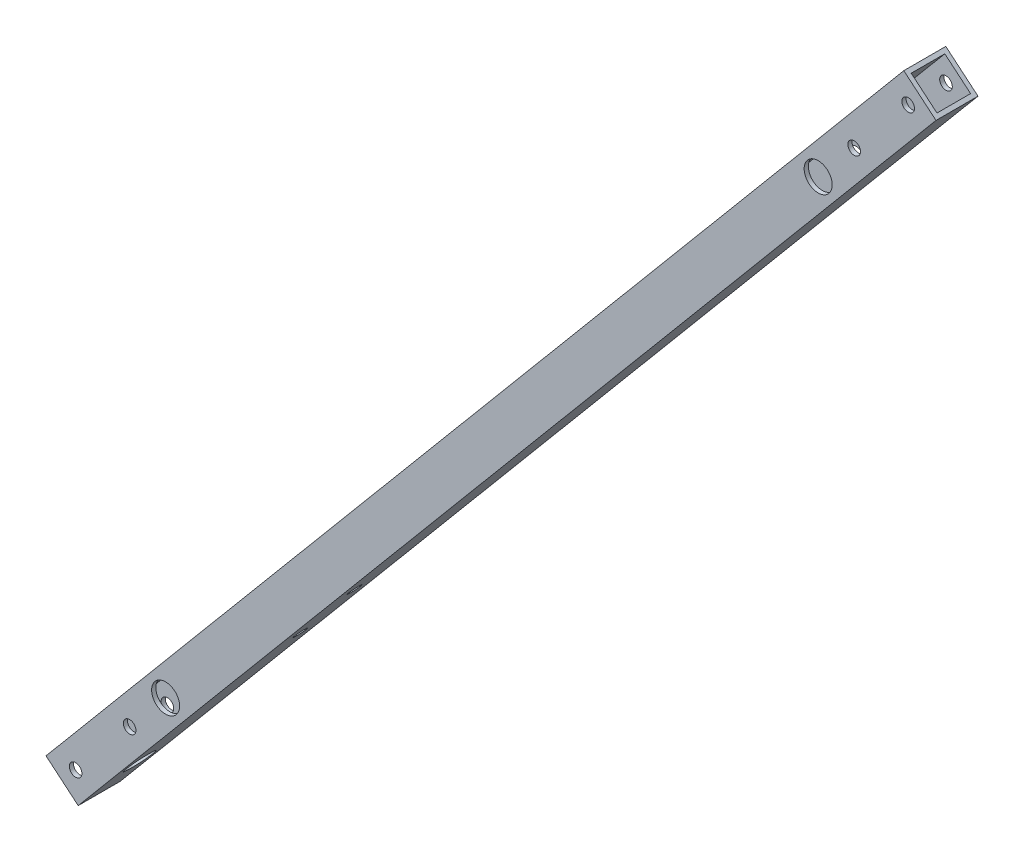
ISO-10303-21;
HEADER;
FILE_DESCRIPTION(('STEP AP214'),'2;1');
FILE_NAME('part.step','',(''),(''),'','','');
FILE_SCHEMA(('AUTOMOTIVE_DESIGN { 1 0 10303 214 1 1 1 1 }'));
ENDSEC;
DATA;
#1=APPLICATION_CONTEXT('core data for automotive mechanical design processes');
#2=APPLICATION_PROTOCOL_DEFINITION('international standard','automotive_design',2000,#1);
#3=PRODUCT_CONTEXT('',#1,'mechanical');
#4=PRODUCT('Part','Part','',(#3));
#5=PRODUCT_RELATED_PRODUCT_CATEGORY('part','',(#4));
#6=PRODUCT_DEFINITION_FORMATION('','',#4);
#7=PRODUCT_DEFINITION_CONTEXT('part definition',#1,'design');
#8=PRODUCT_DEFINITION('design','',#6,#7);
#9=PRODUCT_DEFINITION_SHAPE('','',#8);
#10=(LENGTH_UNIT() NAMED_UNIT(*) SI_UNIT(.MILLI.,.METRE.));
#11=(NAMED_UNIT(*) PLANE_ANGLE_UNIT() SI_UNIT($,.RADIAN.));
#12=(NAMED_UNIT(*) SI_UNIT($,.STERADIAN.) SOLID_ANGLE_UNIT());
#13=UNCERTAINTY_MEASURE_WITH_UNIT(LENGTH_MEASURE(1.E-05),#10,'distance_accuracy_value','');
#14=(GEOMETRIC_REPRESENTATION_CONTEXT(3) GLOBAL_UNCERTAINTY_ASSIGNED_CONTEXT((#13)) GLOBAL_UNIT_ASSIGNED_CONTEXT((#10,
#11,#12)) REPRESENTATION_CONTEXT('',''));
#15=CARTESIAN_POINT('',(0.,0.,0.));
#16=DIRECTION('',(0.,0.,1.));
#17=DIRECTION('',(1.,0.,0.));
#18=AXIS2_PLACEMENT_3D('',#15,#16,#17);
#19=CARTESIAN_POINT('',(0.,0.,13.5));
#20=DIRECTION('',(0.,0.,-1.));
#21=DIRECTION('',(-1.,0.,0.));
#22=AXIS2_PLACEMENT_3D('',#19,#20,#21);
#23=PLANE('',#22);
#24=CARTESIAN_POINT('',(31.2149542335838,48.8684625519902,13.5));
#25=DIRECTION('',(0.,0.,1.));
#26=DIRECTION('',(1.,0.,0.));
#27=AXIS2_PLACEMENT_3D('',#24,#25,#26);
#28=CIRCLE('',#27,4.99999999999999);
#29=CARTESIAN_POINT('',(36.2149542335838,48.8684625519902,13.5));
#30=VERTEX_POINT('',#29);
#31=EDGE_CURVE('E401',#30,#30,#28,.T.);
#32=ORIENTED_EDGE('',*,*,#31,.T.);
#33=EDGE_LOOP('',(#32));
#34=FACE_BOUND('',#33,.T.);
#35=CARTESIAN_POINT('',(277.034916912995,341.825286206554,13.5));
#36=DIRECTION('',(0.,0.,-1.));
#37=DIRECTION('',(-1.,0.,0.));
#38=AXIS2_PLACEMENT_3D('',#35,#36,#37);
#39=CIRCLE('',#38,2.24999999999996);
#40=CARTESIAN_POINT('',(274.784916912995,341.825286206554,13.5));
#41=VERTEX_POINT('',#40);
#42=EDGE_CURVE('E196',#41,#41,#39,.T.);
#43=ORIENTED_EDGE('',*,*,#42,.F.);
#44=EDGE_LOOP('',(#43));
#45=FACE_BOUND('',#44,.T.);
#46=CARTESIAN_POINT('',(18.3592020398528,33.5475736896108,13.5));
#47=DIRECTION('',(0.,0.,-1.));
#48=DIRECTION('',(-1.,0.,0.));
#49=AXIS2_PLACEMENT_3D('',#46,#47,#48);
#50=CIRCLE('',#49,2.25);
#51=CARTESIAN_POINT('',(16.1092020398528,33.5475736896108,13.5));
#52=VERTEX_POINT('',#51);
#53=EDGE_CURVE('E201',#52,#52,#50,.T.);
#54=ORIENTED_EDGE('',*,*,#53,.F.);
#55=EDGE_LOOP('',(#54));
#56=FACE_BOUND('',#55,.T.);
#57=CARTESIAN_POINT('',(-0.924426250743316,10.5662403960414,13.5));
#58=DIRECTION('',(0.,0.,-1.));
#59=DIRECTION('',(-1.,0.,0.));
#60=AXIS2_PLACEMENT_3D('',#57,#58,#59);
#61=CIRCLE('',#60,2.25);
#62=CARTESIAN_POINT('',(-3.17442625074332,10.5662403960414,13.5));
#63=VERTEX_POINT('',#62);
#64=EDGE_CURVE('E207',#63,#63,#61,.T.);
#65=ORIENTED_EDGE('',*,*,#64,.F.);
#66=EDGE_LOOP('',(#65));
#67=FACE_BOUND('',#66,.T.);
#68=CARTESIAN_POINT('',(296.318545203591,364.806619500123,13.5));
#69=DIRECTION('',(0.,0.,-1.));
#70=DIRECTION('',(-1.,0.,0.));
#71=AXIS2_PLACEMENT_3D('',#68,#69,#70);
#72=CIRCLE('',#71,2.24999999999996);
#73=CARTESIAN_POINT('',(294.068545203591,364.806619500123,13.5));
#74=VERTEX_POINT('',#73);
#75=EDGE_CURVE('E219',#74,#74,#72,.T.);
#76=ORIENTED_EDGE('',*,*,#75,.F.);
#77=EDGE_LOOP('',(#76));
#78=FACE_BOUND('',#77,.T.);
#79=DIRECTION('',(0.766044443118979,-0.642787609686539,0.));
#80=VECTOR('',#79,1.);
#81=CARTESIAN_POINT('',(295.900398007839,373.642634038516,13.5));
#82=LINE('',#81,#80);
#83=CARTESIAN_POINT('',(295.900398007839,373.642634038516,13.5));
#84=VERTEX_POINT('',#83);
#85=CARTESIAN_POINT('',(305.092931325267,365.929182722278,13.5));
#86=VERTEX_POINT('',#85);
#87=EDGE_CURVE('E429',#84,#86,#82,.T.);
#88=ORIENTED_EDGE('',*,*,#87,.T.);
#89=DIRECTION('',(0.642787609686538,0.766044443118979,0.));
#90=VECTOR('',#89,1.);
#91=CARTESIAN_POINT('',(-1.14906666467847,0.964181414529808,13.5));
#92=LINE('',#91,#90);
#93=CARTESIAN_POINT('',(-1.14906666467847,0.964181414529808,13.5));
#94=VERTEX_POINT('',#93);
#95=EDGE_CURVE('E125',#94,#86,#92,.T.);
#96=ORIENTED_EDGE('',*,*,#95,.F.);
#97=DIRECTION('',(0.76604444311898,-0.642787609686537,0.));
#98=VECTOR('',#97,1.);
#99=CARTESIAN_POINT('',(0.,0.,13.5));
#100=LINE('',#99,#98);
#101=CARTESIAN_POINT('',(-10.3415999821062,8.67763273076828,13.5));
#102=VERTEX_POINT('',#101);
#103=EDGE_CURVE('E139',#102,#94,#100,.T.);
#104=ORIENTED_EDGE('',*,*,#103,.F.);
#105=DIRECTION('',(-0.642787609686538,-0.766044443118979,0.));
#106=VECTOR('',#105,1.);
#107=CARTESIAN_POINT('',(-10.3415999821063,8.67763273076831,13.5));
#108=LINE('',#107,#106);
#109=EDGE_CURVE('E148',#84,#102,#108,.T.);
#110=ORIENTED_EDGE('',*,*,#109,.F.);
#111=EDGE_LOOP('',(#88,#96,#104,#110));
#112=FACE_BOUND('',#111,.T.);
#113=CARTESIAN_POINT('',(264.179164719264,326.504397344175,13.5));
#114=DIRECTION('',(0.,0.,1.));
#115=DIRECTION('',(1.,0.,0.));
#116=AXIS2_PLACEMENT_3D('',#113,#114,#115);
#117=CIRCLE('',#116,5.);
#118=CARTESIAN_POINT('',(269.179164719264,326.504397344175,13.5));
#119=VERTEX_POINT('',#118);
#120=EDGE_CURVE('E416',#119,#119,#117,.T.);
#121=ORIENTED_EDGE('',*,*,#120,.T.);
#122=EDGE_LOOP('',(#121));
#123=FACE_BOUND('',#122,.T.);
#124=ADVANCED_FACE('F43',(#34,#45,#56,#67,#78,#112,#123),#23,.T.);
#125=CARTESIAN_POINT('',(305.735718934954,366.695227165397,15.));
#126=DIRECTION('',(-0.766044443118979,0.642787609686538,0.));
#127=DIRECTION('',(-0.642787609686538,-0.766044443118979,0.));
#128=AXIS2_PLACEMENT_3D('',#125,#126,#127);
#129=PLANE('',#128);
#130=CARTESIAN_POINT('',(70.7289904301706,86.6251141860083,7.5));
#131=DIRECTION('',(-0.766044443118979,0.642787609686538,0.));
#132=DIRECTION('',(-0.642787609686538,-0.766044443118979,0.));
#133=AXIS2_PLACEMENT_3D('',#130,#131,#132);
#134=CIRCLE('',#133,2.25);
#135=CARTESIAN_POINT('',(69.2827183083759,84.9015141889906,7.5));
#136=VERTEX_POINT('',#135);
#137=EDGE_CURVE('E227',#136,#136,#134,.T.);
#138=ORIENTED_EDGE('',*,*,#137,.F.);
#139=EDGE_LOOP('',(#138));
#140=FACE_BOUND('',#139,.T.);
#141=CARTESIAN_POINT('',(90.0126187207668,109.606447479578,7.5));
#142=DIRECTION('',(-0.766044443118979,0.642787609686538,0.));
#143=DIRECTION('',(-0.642787609686538,-0.766044443118979,0.));
#144=AXIS2_PLACEMENT_3D('',#141,#142,#143);
#145=CIRCLE('',#144,2.25);
#146=CARTESIAN_POINT('',(88.566346598972,107.88284748256,7.5));
#147=VERTEX_POINT('',#146);
#148=EDGE_CURVE('E245',#147,#147,#145,.T.);
#149=ORIENTED_EDGE('',*,*,#148,.F.);
#150=EDGE_LOOP('',(#149));
#151=FACE_BOUND('',#150,.T.);
#152=DIRECTION('',(0.,0.,-1.));
#153=VECTOR('',#152,1.);
#154=CARTESIAN_POINT('',(305.092931325267,365.929182722278,13.5));
#155=LINE('',#154,#153);
#156=CARTESIAN_POINT('',(305.092931325267,365.929182722278,1.5));
#157=VERTEX_POINT('',#156);
#158=EDGE_CURVE('E111',#86,#157,#155,.T.);
#159=ORIENTED_EDGE('',*,*,#158,.T.);
#160=DIRECTION('',(0.642787609686538,0.766044443118979,0.));
#161=VECTOR('',#160,1.);
#162=CARTESIAN_POINT('',(-1.14906666467847,0.964181414529808,1.5));
#163=LINE('',#162,#161);
#164=CARTESIAN_POINT('',(-1.14906666467847,0.964181414529808,1.5));
#165=VERTEX_POINT('',#164);
#166=EDGE_CURVE('E123',#165,#157,#163,.T.);
#167=ORIENTED_EDGE('',*,*,#166,.F.);
#168=DIRECTION('',(0.,0.,-1.));
#169=VECTOR('',#168,1.);
#170=CARTESIAN_POINT('',(-1.14906666467846,0.964181414529863,15.));
#171=LINE('',#170,#169);
#172=EDGE_CURVE('E152',#94,#165,#171,.T.);
#173=ORIENTED_EDGE('',*,*,#172,.F.);
#174=ORIENTED_EDGE('',*,*,#95,.T.);
#175=EDGE_LOOP('',(#159,#167,#173,#174));
#176=FACE_BOUND('',#175,.T.);
#177=CARTESIAN_POINT('',(13.3136545532686,18.2001813847068,7.5));
#178=DIRECTION('',(0.766044443118979,-0.642787609686538,0.));
#179=DIRECTION('',(0.642787609686538,0.766044443118979,0.));
#180=AXIS2_PLACEMENT_3D('',#177,#178,#179);
#181=CIRCLE('',#180,4.99999999999999);
#182=CARTESIAN_POINT('',(16.5275926017013,22.0304036003017,7.5));
#183=VERTEX_POINT('',#182);
#184=EDGE_CURVE('E127',#183,#183,#181,.T.);
#185=ORIENTED_EDGE('',*,*,#184,.T.);
#186=EDGE_LOOP('',(#185));
#187=FACE_BOUND('',#186,.T.);
#188=ADVANCED_FACE('F120',(#140,#151,#176,#187),#129,.T.);
#189=CARTESIAN_POINT('',(-11.4906666467847,9.64181414529806,15.));
#190=DIRECTION('',(0.642787609686537,0.76604444311898,0.));
#191=DIRECTION('',(-0.76604444311898,0.642787609686537,0.));
#192=AXIS2_PLACEMENT_3D('',#189,#190,#191);
#193=PLANE('',#192);
#194=DIRECTION('',(0.76604444311898,-0.642787609686537,0.));
#195=VECTOR('',#194,1.);
#196=CARTESIAN_POINT('',(-11.4906666467847,9.64181414529806,0.));
#197=LINE('',#196,#195);
#198=CARTESIAN_POINT('',(-11.4906666467847,9.64181414529806,0.));
#199=VERTEX_POINT('',#198);
#200=CARTESIAN_POINT('',(0.,0.,0.));
#201=VERTEX_POINT('',#200);
#202=EDGE_CURVE('E155',#199,#201,#197,.T.);
#203=ORIENTED_EDGE('',*,*,#202,.T.);
#204=DIRECTION('',(0.,0.,-1.));
#205=VECTOR('',#204,1.);
#206=CARTESIAN_POINT('',(0.,0.,15.));
#207=LINE('',#206,#205);
#208=CARTESIAN_POINT('',(0.,0.,15.));
#209=VERTEX_POINT('',#208);
#210=EDGE_CURVE('E11',#209,#201,#207,.T.);
#211=ORIENTED_EDGE('',*,*,#210,.F.);
#212=DIRECTION('',(0.76604444311898,-0.642787609686537,0.));
#213=VECTOR('',#212,1.);
#214=CARTESIAN_POINT('',(-11.4906666467847,9.64181414529806,15.));
#215=LINE('',#214,#213);
#216=CARTESIAN_POINT('',(-11.4906666467847,9.64181414529806,15.));
#217=VERTEX_POINT('',#216);
#218=EDGE_CURVE('E162',#217,#209,#215,.T.);
#219=ORIENTED_EDGE('',*,*,#218,.F.);
#220=DIRECTION('',(0.,0.,-1.));
#221=VECTOR('',#220,1.);
#222=CARTESIAN_POINT('',(-11.4906666467847,9.64181414529806,15.));
#223=LINE('',#222,#221);
#224=EDGE_CURVE('E53',#217,#199,#223,.T.);
#225=ORIENTED_EDGE('',*,*,#224,.T.);
#226=EDGE_LOOP('',(#203,#211,#219,#225));
#227=FACE_BOUND('',#226,.T.);
#228=DIRECTION('',(0.76604444311898,-0.642787609686537,0.));
#229=VECTOR('',#228,1.);
#230=CARTESIAN_POINT('',(0.,0.,1.5));
#231=LINE('',#230,#229);
#232=CARTESIAN_POINT('',(-10.3415999821062,8.67763273076828,1.5));
#233=VERTEX_POINT('',#232);
#234=EDGE_CURVE('E131',#233,#165,#231,.T.);
#235=ORIENTED_EDGE('',*,*,#234,.F.);
#236=DIRECTION('',(0.,0.,-1.));
#237=VECTOR('',#236,1.);
#238=CARTESIAN_POINT('',(-10.3415999821062,8.67763273076828,15.));
#239=LINE('',#238,#237);
#240=EDGE_CURVE('E150',#102,#233,#239,.T.);
#241=ORIENTED_EDGE('',*,*,#240,.F.);
#242=ORIENTED_EDGE('',*,*,#103,.T.);
#243=ORIENTED_EDGE('',*,*,#172,.T.);
#244=EDGE_LOOP('',(#235,#241,#242,#243));
#245=FACE_BOUND('',#244,.T.);
#246=ADVANCED_FACE('F45',(#227,#245),#193,.F.);
#247=CARTESIAN_POINT('',(306.884785599632,365.731045750867,15.));
#248=DIRECTION('',(-0.766044443118979,0.642787609686538,0.));
#249=DIRECTION('',(-0.642787609686538,-0.766044443118979,0.));
#250=AXIS2_PLACEMENT_3D('',#247,#248,#249);
#251=PLANE('',#250);
#252=CARTESIAN_POINT('',(14.4627212179471,17.235999970177,7.5));
#253=DIRECTION('',(0.766044443118979,-0.642787609686538,0.));
#254=DIRECTION('',(0.642787609686538,0.766044443118979,0.));
#255=AXIS2_PLACEMENT_3D('',#252,#253,#254);
#256=CIRCLE('',#255,4.99999999999999);
#257=CARTESIAN_POINT('',(17.6766592663798,21.0662221857719,7.5));
#258=VERTEX_POINT('',#257);
#259=EDGE_CURVE('E420',#258,#258,#256,.T.);
#260=ORIENTED_EDGE('',*,*,#259,.F.);
#261=EDGE_LOOP('',(#260));
#262=FACE_BOUND('',#261,.T.);
#263=CARTESIAN_POINT('',(91.1616853854452,108.642266065048,7.5));
#264=DIRECTION('',(-0.766044443118979,0.642787609686538,0.));
#265=DIRECTION('',(-0.642787609686538,-0.766044443118979,0.));
#266=AXIS2_PLACEMENT_3D('',#263,#264,#265);
#267=CIRCLE('',#266,2.25);
#268=CARTESIAN_POINT('',(89.7154132636505,106.91866606803,7.5));
#269=VERTEX_POINT('',#268);
#270=EDGE_CURVE('E249',#269,#269,#267,.T.);
#271=ORIENTED_EDGE('',*,*,#270,.T.);
#272=EDGE_LOOP('',(#271));
#273=FACE_BOUND('',#272,.T.);
#274=CARTESIAN_POINT('',(71.8780570948491,85.6609327714785,7.5));
#275=DIRECTION('',(-0.766044443118979,0.642787609686538,0.));
#276=DIRECTION('',(-0.642787609686538,-0.766044443118979,0.));
#277=AXIS2_PLACEMENT_3D('',#274,#275,#276);
#278=CIRCLE('',#277,2.25);
#279=CARTESIAN_POINT('',(70.4317849730544,83.9373327744608,7.5));
#280=VERTEX_POINT('',#279);
#281=EDGE_CURVE('E233',#280,#280,#278,.T.);
#282=ORIENTED_EDGE('',*,*,#281,.T.);
#283=EDGE_LOOP('',(#282));
#284=FACE_BOUND('',#283,.T.);
#285=DIRECTION('',(0.642787609686538,0.766044443118979,0.));
#286=VECTOR('',#285,1.);
#287=CARTESIAN_POINT('',(306.884785599632,365.731045750867,0.));
#288=LINE('',#287,#286);
#289=CARTESIAN_POINT('',(306.241997989946,364.965001307748,0.));
#290=VERTEX_POINT('',#289);
#291=EDGE_CURVE('E177',#201,#290,#288,.T.);
#292=ORIENTED_EDGE('',*,*,#291,.T.);
#293=DIRECTION('',(0.,0.,-1.));
#294=VECTOR('',#293,1.);
#295=CARTESIAN_POINT('',(306.241997989946,364.965001307748,15.));
#296=LINE('',#295,#294);
#297=CARTESIAN_POINT('',(306.241997989946,364.965001307748,15.));
#298=VERTEX_POINT('',#297);
#299=EDGE_CURVE('E61',#298,#290,#296,.T.);
#300=ORIENTED_EDGE('',*,*,#299,.F.);
#301=DIRECTION('',(0.642787609686538,0.766044443118979,0.));
#302=VECTOR('',#301,1.);
#303=CARTESIAN_POINT('',(306.884785599632,365.731045750867,15.));
#304=LINE('',#303,#302);
#305=EDGE_CURVE('E166',#209,#298,#304,.T.);
#306=ORIENTED_EDGE('',*,*,#305,.F.);
#307=ORIENTED_EDGE('',*,*,#210,.T.);
#308=EDGE_LOOP('',(#292,#300,#306,#307));
#309=FACE_BOUND('',#308,.T.);
#310=ADVANCED_FACE('F460',(#262,#273,#284,#309),#251,.F.);
#311=CARTESIAN_POINT('',(295.394118952847,375.372859896165,15.));
#312=DIRECTION('',(0.766044443118979,-0.642787609686538,0.));
#313=DIRECTION('',(0.642787609686538,0.766044443118979,0.));
#314=AXIS2_PLACEMENT_3D('',#311,#312,#313);
#315=PLANE('',#314);
#316=CARTESIAN_POINT('',(79.6710187386605,118.284080210346,7.5));
#317=DIRECTION('',(-0.76604444311898,0.642787609686538,0.));
#318=DIRECTION('',(-0.642787609686538,-0.766044443118979,0.));
#319=AXIS2_PLACEMENT_3D('',#316,#317,#318);
#320=CIRCLE('',#319,2.25);
#321=CARTESIAN_POINT('',(78.2247466168658,116.560480213328,7.5));
#322=VERTEX_POINT('',#321);
#323=EDGE_CURVE('E224',#322,#322,#320,.T.);
#324=ORIENTED_EDGE('',*,*,#323,.F.);
#325=EDGE_LOOP('',(#324));
#326=FACE_BOUND('',#325,.T.);
#327=CARTESIAN_POINT('',(60.3873904480644,95.3027469167766,7.5));
#328=DIRECTION('',(-0.76604444311898,0.642787609686538,0.));
#329=DIRECTION('',(-0.642787609686538,-0.766044443118979,0.));
#330=AXIS2_PLACEMENT_3D('',#327,#328,#329);
#331=CIRCLE('',#330,2.25);
#332=CARTESIAN_POINT('',(58.9411183262697,93.5791469197589,7.5));
#333=VERTEX_POINT('',#332);
#334=EDGE_CURVE('E445',#333,#333,#331,.T.);
#335=ORIENTED_EDGE('',*,*,#334,.F.);
#336=EDGE_LOOP('',(#335));
#337=FACE_BOUND('',#336,.T.);
#338=CARTESIAN_POINT('',(2.9720545711624,26.8778141154751,7.5));
#339=DIRECTION('',(-0.76604444311898,0.642787609686538,0.));
#340=DIRECTION('',(-0.642787609686538,-0.766044443118979,0.));
#341=AXIS2_PLACEMENT_3D('',#338,#339,#340);
#342=CIRCLE('',#341,2.7);
#343=CARTESIAN_POINT('',(1.23652802500874,24.8094941190539,7.5));
#344=VERTEX_POINT('',#343);
#345=EDGE_CURVE('E242',#344,#344,#342,.T.);
#346=ORIENTED_EDGE('',*,*,#345,.F.);
#347=EDGE_LOOP('',(#346));
#348=FACE_BOUND('',#347,.T.);
#349=DIRECTION('',(-0.642787609686538,-0.766044443118979,0.));
#350=VECTOR('',#349,1.);
#351=CARTESIAN_POINT('',(295.394118952847,375.372859896165,15.));
#352=LINE('',#351,#350);
#353=CARTESIAN_POINT('',(294.751331343161,374.606815453046,15.));
#354=VERTEX_POINT('',#353);
#355=EDGE_CURVE('E171',#354,#217,#352,.T.);
#356=ORIENTED_EDGE('',*,*,#355,.F.);
#357=DIRECTION('',(0.,0.,1.));
#358=VECTOR('',#357,1.);
#359=CARTESIAN_POINT('',(294.751331343161,374.606815453046,15.));
#360=LINE('',#359,#358);
#361=CARTESIAN_POINT('',(294.751331343161,374.606815453046,0.));
#362=VERTEX_POINT('',#361);
#363=EDGE_CURVE('E437',#362,#354,#360,.T.);
#364=ORIENTED_EDGE('',*,*,#363,.F.);
#365=DIRECTION('',(-0.642787609686538,-0.766044443118979,0.));
#366=VECTOR('',#365,1.);
#367=CARTESIAN_POINT('',(295.394118952847,375.372859896165,0.));
#368=LINE('',#367,#366);
#369=EDGE_CURVE('E167',#362,#199,#368,.T.);
#370=ORIENTED_EDGE('',*,*,#369,.T.);
#371=ORIENTED_EDGE('',*,*,#224,.F.);
#372=EDGE_LOOP('',(#356,#364,#370,#371));
#373=FACE_BOUND('',#372,.T.);
#374=ADVANCED_FACE('F457',(#326,#337,#348,#373),#315,.F.);
#375=CARTESIAN_POINT('',(0.,0.,15.));
#376=DIRECTION('',(0.,0.,-1.));
#377=DIRECTION('',(-1.,0.,0.));
#378=AXIS2_PLACEMENT_3D('',#375,#376,#377);
#379=PLANE('',#378);
#380=CARTESIAN_POINT('',(31.2149542335838,48.8684625519902,15.));
#381=DIRECTION('',(0.,0.,1.));
#382=DIRECTION('',(1.,0.,0.));
#383=AXIS2_PLACEMENT_3D('',#380,#381,#382);
#384=CIRCLE('',#383,4.99999999999999);
#385=CARTESIAN_POINT('',(36.2149542335838,48.8684625519902,15.));
#386=VERTEX_POINT('',#385);
#387=EDGE_CURVE('E404',#386,#386,#384,.T.);
#388=ORIENTED_EDGE('',*,*,#387,.F.);
#389=EDGE_LOOP('',(#388));
#390=FACE_BOUND('',#389,.T.);
#391=CARTESIAN_POINT('',(264.179164719264,326.504397344175,15.));
#392=DIRECTION('',(0.,0.,1.));
#393=DIRECTION('',(1.,0.,0.));
#394=AXIS2_PLACEMENT_3D('',#391,#392,#393);
#395=CIRCLE('',#394,5.);
#396=CARTESIAN_POINT('',(269.179164719264,326.504397344175,15.));
#397=VERTEX_POINT('',#396);
#398=EDGE_CURVE('E410',#397,#397,#395,.T.);
#399=ORIENTED_EDGE('',*,*,#398,.F.);
#400=EDGE_LOOP('',(#399));
#401=FACE_BOUND('',#400,.T.);
#402=CARTESIAN_POINT('',(296.318545203591,364.806619500123,15.));
#403=DIRECTION('',(0.,0.,1.));
#404=DIRECTION('',(1.,0.,0.));
#405=AXIS2_PLACEMENT_3D('',#402,#403,#404);
#406=CIRCLE('',#405,2.24999999999996);
#407=CARTESIAN_POINT('',(298.568545203591,364.806619500123,15.));
#408=VERTEX_POINT('',#407);
#409=EDGE_CURVE('E253',#408,#408,#406,.T.);
#410=ORIENTED_EDGE('',*,*,#409,.F.);
#411=EDGE_LOOP('',(#410));
#412=FACE_BOUND('',#411,.T.);
#413=CARTESIAN_POINT('',(-0.924426250743316,10.5662403960414,15.));
#414=DIRECTION('',(0.,0.,1.));
#415=DIRECTION('',(1.,0.,0.));
#416=AXIS2_PLACEMENT_3D('',#413,#414,#415);
#417=CIRCLE('',#416,2.25);
#418=CARTESIAN_POINT('',(1.32557374925668,10.5662403960414,15.));
#419=VERTEX_POINT('',#418);
#420=EDGE_CURVE('E191',#419,#419,#417,.T.);
#421=ORIENTED_EDGE('',*,*,#420,.F.);
#422=EDGE_LOOP('',(#421));
#423=FACE_BOUND('',#422,.T.);
#424=CARTESIAN_POINT('',(18.3592020398528,33.5475736896108,15.));
#425=DIRECTION('',(0.,0.,1.));
#426=DIRECTION('',(1.,0.,0.));
#427=AXIS2_PLACEMENT_3D('',#424,#425,#426);
#428=CIRCLE('',#427,2.25);
#429=CARTESIAN_POINT('',(20.6092020398528,33.5475736896108,15.));
#430=VERTEX_POINT('',#429);
#431=EDGE_CURVE('E254',#430,#430,#428,.T.);
#432=ORIENTED_EDGE('',*,*,#431,.F.);
#433=EDGE_LOOP('',(#432));
#434=FACE_BOUND('',#433,.T.);
#435=CARTESIAN_POINT('',(277.034916912995,341.825286206554,15.));
#436=DIRECTION('',(0.,0.,1.));
#437=DIRECTION('',(1.,0.,0.));
#438=AXIS2_PLACEMENT_3D('',#435,#436,#437);
#439=CIRCLE('',#438,2.24999999999996);
#440=CARTESIAN_POINT('',(279.284916912994,341.825286206554,15.));
#441=VERTEX_POINT('',#440);
#442=EDGE_CURVE('E258',#441,#441,#439,.T.);
#443=ORIENTED_EDGE('',*,*,#442,.F.);
#444=EDGE_LOOP('',(#443));
#445=FACE_BOUND('',#444,.T.);
#446=ORIENTED_EDGE('',*,*,#305,.T.);
#447=DIRECTION('',(0.76604444311898,-0.642787609686537,0.));
#448=VECTOR('',#447,1.);
#449=CARTESIAN_POINT('',(294.751331343161,374.606815453046,15.));
#450=LINE('',#449,#448);
#451=EDGE_CURVE('E440',#354,#298,#450,.T.);
#452=ORIENTED_EDGE('',*,*,#451,.F.);
#453=ORIENTED_EDGE('',*,*,#355,.T.);
#454=ORIENTED_EDGE('',*,*,#218,.T.);
#455=EDGE_LOOP('',(#446,#452,#453,#454));
#456=FACE_BOUND('',#455,.T.);
#457=ADVANCED_FACE('F308',(#390,#401,#412,#423,#434,#445,#456),#379,.F.);
#458=CARTESIAN_POINT('',(0.,0.,0.));
#459=DIRECTION('',(0.,0.,-1.));
#460=DIRECTION('',(-1.,0.,0.));
#461=AXIS2_PLACEMENT_3D('',#458,#459,#460);
#462=PLANE('',#461);
#463=DIRECTION('',(-0.76604444311898,0.642787609686537,0.));
#464=VECTOR('',#463,1.);
#465=CARTESIAN_POINT('',(294.751331343161,374.606815453046,0.));
#466=LINE('',#465,#464);
#467=EDGE_CURVE('E434',#290,#362,#466,.T.);
#468=ORIENTED_EDGE('',*,*,#467,.F.);
#469=ORIENTED_EDGE('',*,*,#291,.F.);
#470=ORIENTED_EDGE('',*,*,#202,.F.);
#471=ORIENTED_EDGE('',*,*,#369,.F.);
#472=EDGE_LOOP('',(#468,#469,#470,#471));
#473=FACE_BOUND('',#472,.T.);
#474=CARTESIAN_POINT('',(296.318545203591,364.806619500123,0.));
#475=DIRECTION('',(0.,0.,-1.));
#476=DIRECTION('',(-1.,0.,0.));
#477=AXIS2_PLACEMENT_3D('',#474,#475,#476);
#478=CIRCLE('',#477,2.24999999999996);
#479=CARTESIAN_POINT('',(294.068545203591,364.806619500123,0.));
#480=VERTEX_POINT('',#479);
#481=EDGE_CURVE('E141',#480,#480,#478,.T.);
#482=ORIENTED_EDGE('',*,*,#481,.F.);
#483=EDGE_LOOP('',(#482));
#484=FACE_BOUND('',#483,.T.);
#485=CARTESIAN_POINT('',(264.179164719264,326.504397344175,0.));
#486=DIRECTION('',(0.,0.,-1.));
#487=DIRECTION('',(-1.,0.,0.));
#488=AXIS2_PLACEMENT_3D('',#485,#486,#487);
#489=CIRCLE('',#488,2.6999999999999);
#490=CARTESIAN_POINT('',(261.479164719264,326.504397344175,0.));
#491=VERTEX_POINT('',#490);
#492=EDGE_CURVE('E213',#491,#491,#489,.T.);
#493=ORIENTED_EDGE('',*,*,#492,.F.);
#494=EDGE_LOOP('',(#493));
#495=FACE_BOUND('',#494,.T.);
#496=CARTESIAN_POINT('',(-0.924426250743316,10.5662403960414,0.));
#497=DIRECTION('',(0.,0.,-1.));
#498=DIRECTION('',(-1.,0.,0.));
#499=AXIS2_PLACEMENT_3D('',#496,#497,#498);
#500=CIRCLE('',#499,2.25);
#501=CARTESIAN_POINT('',(-3.17442625074332,10.5662403960414,0.));
#502=VERTEX_POINT('',#501);
#503=EDGE_CURVE('E214',#502,#502,#500,.T.);
#504=ORIENTED_EDGE('',*,*,#503,.F.);
#505=EDGE_LOOP('',(#504));
#506=FACE_BOUND('',#505,.T.);
#507=CARTESIAN_POINT('',(18.3592020398528,33.5475736896108,0.));
#508=DIRECTION('',(0.,0.,-1.));
#509=DIRECTION('',(-1.,0.,0.));
#510=AXIS2_PLACEMENT_3D('',#507,#508,#509);
#511=CIRCLE('',#510,2.25);
#512=CARTESIAN_POINT('',(16.1092020398528,33.5475736896108,0.));
#513=VERTEX_POINT('',#512);
#514=EDGE_CURVE('E208',#513,#513,#511,.T.);
#515=ORIENTED_EDGE('',*,*,#514,.F.);
#516=EDGE_LOOP('',(#515));
#517=FACE_BOUND('',#516,.T.);
#518=CARTESIAN_POINT('',(277.034916912995,341.825286206554,0.));
#519=DIRECTION('',(0.,0.,-1.));
#520=DIRECTION('',(-1.,0.,0.));
#521=AXIS2_PLACEMENT_3D('',#518,#519,#520);
#522=CIRCLE('',#521,2.24999999999996);
#523=CARTESIAN_POINT('',(274.784916912995,341.825286206554,0.));
#524=VERTEX_POINT('',#523);
#525=EDGE_CURVE('E202',#524,#524,#522,.T.);
#526=ORIENTED_EDGE('',*,*,#525,.F.);
#527=EDGE_LOOP('',(#526));
#528=FACE_BOUND('',#527,.T.);
#529=CARTESIAN_POINT('',(31.2149542335838,48.8684625519902,0.));
#530=DIRECTION('',(0.,0.,-1.));
#531=DIRECTION('',(-1.,0.,0.));
#532=AXIS2_PLACEMENT_3D('',#529,#530,#531);
#533=CIRCLE('',#532,2.7);
#534=CARTESIAN_POINT('',(28.5149542335838,48.8684625519902,0.));
#535=VERTEX_POINT('',#534);
#536=EDGE_CURVE('E190',#535,#535,#533,.T.);
#537=ORIENTED_EDGE('',*,*,#536,.F.);
#538=EDGE_LOOP('',(#537));
#539=FACE_BOUND('',#538,.T.);
#540=ADVANCED_FACE('F304',(#473,#484,#495,#506,#517,#528,#539),#462,.T.);
#541=CARTESIAN_POINT('',(296.543185617526,374.408678481635,15.));
#542=DIRECTION('',(0.766044443118979,-0.642787609686538,0.));
#543=DIRECTION('',(0.642787609686538,0.766044443118979,0.));
#544=AXIS2_PLACEMENT_3D('',#541,#542,#543);
#545=PLANE('',#544);
#546=DIRECTION('',(0.,0.,1.));
#547=VECTOR('',#546,1.);
#548=CARTESIAN_POINT('',(295.900398007839,373.642634038516,13.5));
#549=LINE('',#548,#547);
#550=CARTESIAN_POINT('',(295.900398007839,373.642634038516,1.5));
#551=VERTEX_POINT('',#550);
#552=EDGE_CURVE('E69',#551,#84,#549,.T.);
#553=ORIENTED_EDGE('',*,*,#552,.T.);
#554=ORIENTED_EDGE('',*,*,#109,.T.);
#555=ORIENTED_EDGE('',*,*,#240,.T.);
#556=DIRECTION('',(-0.642787609686538,-0.766044443118979,0.));
#557=VECTOR('',#556,1.);
#558=CARTESIAN_POINT('',(-10.3415999821063,8.67763273076831,1.5));
#559=LINE('',#558,#557);
#560=EDGE_CURVE('E134',#551,#233,#559,.T.);
#561=ORIENTED_EDGE('',*,*,#560,.F.);
#562=EDGE_LOOP('',(#553,#554,#555,#561));
#563=FACE_BOUND('',#562,.T.);
#564=CARTESIAN_POINT('',(80.820085403339,117.319898795816,7.5));
#565=DIRECTION('',(0.766044443118979,-0.642787609686538,0.));
#566=DIRECTION('',(0.642787609686538,0.766044443118979,0.));
#567=AXIS2_PLACEMENT_3D('',#564,#565,#566);
#568=CIRCLE('',#567,2.25);
#569=CARTESIAN_POINT('',(82.2663575251337,119.043498792834,7.5));
#570=VERTEX_POINT('',#569);
#571=EDGE_CURVE('E47',#570,#570,#568,.T.);
#572=ORIENTED_EDGE('',*,*,#571,.F.);
#573=EDGE_LOOP('',(#572));
#574=FACE_BOUND('',#573,.T.);
#575=CARTESIAN_POINT('',(61.5364571127428,94.3385655022468,7.5));
#576=DIRECTION('',(0.766044443118979,-0.642787609686538,0.));
#577=DIRECTION('',(0.642787609686538,0.766044443118979,0.));
#578=AXIS2_PLACEMENT_3D('',#575,#576,#577);
#579=CIRCLE('',#578,2.25);
#580=CARTESIAN_POINT('',(62.9827292345375,96.0621654992646,7.5));
#581=VERTEX_POINT('',#580);
#582=EDGE_CURVE('E223',#581,#581,#579,.T.);
#583=ORIENTED_EDGE('',*,*,#582,.F.);
#584=EDGE_LOOP('',(#583));
#585=FACE_BOUND('',#584,.T.);
#586=CARTESIAN_POINT('',(4.12112123584085,25.9136327009453,7.5));
#587=DIRECTION('',(0.766044443118979,-0.642787609686538,0.));
#588=DIRECTION('',(0.642787609686538,0.766044443118979,0.));
#589=AXIS2_PLACEMENT_3D('',#586,#587,#588);
#590=CIRCLE('',#589,2.7);
#591=CARTESIAN_POINT('',(5.85664778199451,27.9819526973666,7.5));
#592=VERTEX_POINT('',#591);
#593=EDGE_CURVE('E220',#592,#592,#590,.T.);
#594=ORIENTED_EDGE('',*,*,#593,.F.);
#595=EDGE_LOOP('',(#594));
#596=FACE_BOUND('',#595,.T.);
#597=ADVANCED_FACE('F307',(#563,#574,#585,#596),#545,.T.);
#598=CARTESIAN_POINT('',(0.,0.,1.5));
#599=DIRECTION('',(0.,0.,-1.));
#600=DIRECTION('',(-1.,0.,0.));
#601=AXIS2_PLACEMENT_3D('',#598,#599,#600);
#602=PLANE('',#601);
#603=CARTESIAN_POINT('',(296.318545203591,364.806619500123,1.5));
#604=DIRECTION('',(0.,0.,-1.));
#605=DIRECTION('',(-1.,0.,0.));
#606=AXIS2_PLACEMENT_3D('',#603,#604,#605);
#607=CIRCLE('',#606,2.24999999999996);
#608=CARTESIAN_POINT('',(294.068545203591,364.806619500123,1.5));
#609=VERTEX_POINT('',#608);
#610=EDGE_CURVE('E215',#609,#609,#607,.T.);
#611=ORIENTED_EDGE('',*,*,#610,.T.);
#612=EDGE_LOOP('',(#611));
#613=FACE_BOUND('',#612,.T.);
#614=CARTESIAN_POINT('',(264.179164719264,326.504397344175,1.5));
#615=DIRECTION('',(0.,0.,-1.));
#616=DIRECTION('',(-1.,0.,0.));
#617=AXIS2_PLACEMENT_3D('',#614,#615,#616);
#618=CIRCLE('',#617,2.6999999999999);
#619=CARTESIAN_POINT('',(261.479164719264,326.504397344175,1.5));
#620=VERTEX_POINT('',#619);
#621=EDGE_CURVE('E209',#620,#620,#618,.T.);
#622=ORIENTED_EDGE('',*,*,#621,.T.);
#623=EDGE_LOOP('',(#622));
#624=FACE_BOUND('',#623,.T.);
#625=CARTESIAN_POINT('',(-0.924426250743316,10.5662403960414,1.5));
#626=DIRECTION('',(0.,0.,-1.));
#627=DIRECTION('',(-1.,0.,0.));
#628=AXIS2_PLACEMENT_3D('',#625,#626,#627);
#629=CIRCLE('',#628,2.25);
#630=CARTESIAN_POINT('',(-3.17442625074332,10.5662403960414,1.5));
#631=VERTEX_POINT('',#630);
#632=EDGE_CURVE('E203',#631,#631,#629,.T.);
#633=ORIENTED_EDGE('',*,*,#632,.T.);
#634=EDGE_LOOP('',(#633));
#635=FACE_BOUND('',#634,.T.);
#636=CARTESIAN_POINT('',(18.3592020398528,33.5475736896108,1.5));
#637=DIRECTION('',(0.,0.,-1.));
#638=DIRECTION('',(-1.,0.,0.));
#639=AXIS2_PLACEMENT_3D('',#636,#637,#638);
#640=CIRCLE('',#639,2.25);
#641=CARTESIAN_POINT('',(16.1092020398528,33.5475736896108,1.5));
#642=VERTEX_POINT('',#641);
#643=EDGE_CURVE('E197',#642,#642,#640,.T.);
#644=ORIENTED_EDGE('',*,*,#643,.T.);
#645=EDGE_LOOP('',(#644));
#646=FACE_BOUND('',#645,.T.);
#647=CARTESIAN_POINT('',(277.034916912995,341.825286206554,1.5));
#648=DIRECTION('',(0.,0.,-1.));
#649=DIRECTION('',(-1.,0.,0.));
#650=AXIS2_PLACEMENT_3D('',#647,#648,#649);
#651=CIRCLE('',#650,2.24999999999996);
#652=CARTESIAN_POINT('',(274.784916912995,341.825286206554,1.5));
#653=VERTEX_POINT('',#652);
#654=EDGE_CURVE('E192',#653,#653,#651,.T.);
#655=ORIENTED_EDGE('',*,*,#654,.T.);
#656=EDGE_LOOP('',(#655));
#657=FACE_BOUND('',#656,.T.);
#658=CARTESIAN_POINT('',(31.2149542335838,48.8684625519902,1.5));
#659=DIRECTION('',(0.,0.,-1.));
#660=DIRECTION('',(-1.,0.,0.));
#661=AXIS2_PLACEMENT_3D('',#658,#659,#660);
#662=CIRCLE('',#661,2.7);
#663=CARTESIAN_POINT('',(28.5149542335838,48.8684625519902,1.5));
#664=VERTEX_POINT('',#663);
#665=EDGE_CURVE('E186',#664,#664,#662,.T.);
#666=ORIENTED_EDGE('',*,*,#665,.T.);
#667=EDGE_LOOP('',(#666));
#668=FACE_BOUND('',#667,.T.);
#669=ORIENTED_EDGE('',*,*,#166,.T.);
#670=DIRECTION('',(-0.766044443118979,0.642787609686539,0.));
#671=VECTOR('',#670,1.);
#672=CARTESIAN_POINT('',(295.900398007839,373.642634038516,1.5));
#673=LINE('',#672,#671);
#674=EDGE_CURVE('E108',#157,#551,#673,.T.);
#675=ORIENTED_EDGE('',*,*,#674,.T.);
#676=ORIENTED_EDGE('',*,*,#560,.T.);
#677=ORIENTED_EDGE('',*,*,#234,.T.);
#678=EDGE_LOOP('',(#669,#675,#676,#677));
#679=FACE_BOUND('',#678,.T.);
#680=ADVANCED_FACE('F129',(#613,#624,#635,#646,#657,#668,#679),#602,.F.);
#681=CARTESIAN_POINT('',(31.2149542335838,48.8684625519902,-10.));
#682=DIRECTION('',(0.,0.,1.));
#683=DIRECTION('',(1.,0.,0.));
#684=AXIS2_PLACEMENT_3D('',#681,#682,#683);
#685=CYLINDRICAL_SURFACE('',#684,2.7);
#686=ORIENTED_EDGE('',*,*,#536,.T.);
#687=EDGE_LOOP('',(#686));
#688=FACE_BOUND('',#687,.T.);
#689=ORIENTED_EDGE('',*,*,#665,.F.);
#690=EDGE_LOOP('',(#689));
#691=FACE_BOUND('',#690,.T.);
#692=ADVANCED_FACE('F321',(#688,#691),#685,.F.);
#693=CARTESIAN_POINT('',(277.034916912995,341.825286206554,-10.));
#694=DIRECTION('',(0.,0.,1.));
#695=DIRECTION('',(1.,0.,0.));
#696=AXIS2_PLACEMENT_3D('',#693,#694,#695);
#697=CYLINDRICAL_SURFACE('',#696,2.24999999999996);
#698=ORIENTED_EDGE('',*,*,#525,.T.);
#699=EDGE_LOOP('',(#698));
#700=FACE_BOUND('',#699,.T.);
#701=ORIENTED_EDGE('',*,*,#654,.F.);
#702=EDGE_LOOP('',(#701));
#703=FACE_BOUND('',#702,.T.);
#704=ADVANCED_FACE('F324',(#700,#703),#697,.F.);
#705=CARTESIAN_POINT('',(18.3592020398528,33.5475736896108,-10.));
#706=DIRECTION('',(0.,0.,1.));
#707=DIRECTION('',(1.,0.,0.));
#708=AXIS2_PLACEMENT_3D('',#705,#706,#707);
#709=CYLINDRICAL_SURFACE('',#708,2.25);
#710=ORIENTED_EDGE('',*,*,#514,.T.);
#711=EDGE_LOOP('',(#710));
#712=FACE_BOUND('',#711,.T.);
#713=ORIENTED_EDGE('',*,*,#643,.F.);
#714=EDGE_LOOP('',(#713));
#715=FACE_BOUND('',#714,.T.);
#716=ADVANCED_FACE('F373',(#712,#715),#709,.F.);
#717=CARTESIAN_POINT('',(-0.924426250743316,10.5662403960414,-10.));
#718=DIRECTION('',(0.,0.,1.));
#719=DIRECTION('',(1.,0.,0.));
#720=AXIS2_PLACEMENT_3D('',#717,#718,#719);
#721=CYLINDRICAL_SURFACE('',#720,2.25);
#722=ORIENTED_EDGE('',*,*,#503,.T.);
#723=EDGE_LOOP('',(#722));
#724=FACE_BOUND('',#723,.T.);
#725=ORIENTED_EDGE('',*,*,#632,.F.);
#726=EDGE_LOOP('',(#725));
#727=FACE_BOUND('',#726,.T.);
#728=ADVANCED_FACE('F361',(#724,#727),#721,.F.);
#729=CARTESIAN_POINT('',(264.179164719264,326.504397344175,-10.));
#730=DIRECTION('',(0.,0.,1.));
#731=DIRECTION('',(1.,0.,0.));
#732=AXIS2_PLACEMENT_3D('',#729,#730,#731);
#733=CYLINDRICAL_SURFACE('',#732,2.6999999999999);
#734=ORIENTED_EDGE('',*,*,#492,.T.);
#735=EDGE_LOOP('',(#734));
#736=FACE_BOUND('',#735,.T.);
#737=ORIENTED_EDGE('',*,*,#621,.F.);
#738=EDGE_LOOP('',(#737));
#739=FACE_BOUND('',#738,.T.);
#740=ADVANCED_FACE('F362',(#736,#739),#733,.F.);
#741=CARTESIAN_POINT('',(296.318545203591,364.806619500123,-10.));
#742=DIRECTION('',(0.,0.,1.));
#743=DIRECTION('',(1.,0.,0.));
#744=AXIS2_PLACEMENT_3D('',#741,#742,#743);
#745=CYLINDRICAL_SURFACE('',#744,2.24999999999996);
#746=ORIENTED_EDGE('',*,*,#481,.T.);
#747=EDGE_LOOP('',(#746));
#748=FACE_BOUND('',#747,.T.);
#749=ORIENTED_EDGE('',*,*,#610,.F.);
#750=EDGE_LOOP('',(#749));
#751=FACE_BOUND('',#750,.T.);
#752=ADVANCED_FACE('F301',(#748,#751),#745,.F.);
#753=ORIENTED_EDGE('',*,*,#42,.T.);
#754=EDGE_LOOP('',(#753));
#755=FACE_BOUND('',#754,.T.);
#756=ORIENTED_EDGE('',*,*,#442,.T.);
#757=EDGE_LOOP('',(#756));
#758=FACE_BOUND('',#757,.T.);
#759=ADVANCED_FACE('F366',(#755,#758),#697,.F.);
#760=ORIENTED_EDGE('',*,*,#53,.T.);
#761=EDGE_LOOP('',(#760));
#762=FACE_BOUND('',#761,.T.);
#763=ORIENTED_EDGE('',*,*,#431,.T.);
#764=EDGE_LOOP('',(#763));
#765=FACE_BOUND('',#764,.T.);
#766=ADVANCED_FACE('F359',(#762,#765),#709,.F.);
#767=ORIENTED_EDGE('',*,*,#64,.T.);
#768=EDGE_LOOP('',(#767));
#769=FACE_BOUND('',#768,.T.);
#770=ORIENTED_EDGE('',*,*,#420,.T.);
#771=EDGE_LOOP('',(#770));
#772=FACE_BOUND('',#771,.T.);
#773=ADVANCED_FACE('F356',(#769,#772),#721,.F.);
#774=ORIENTED_EDGE('',*,*,#75,.T.);
#775=EDGE_LOOP('',(#774));
#776=FACE_BOUND('',#775,.T.);
#777=ORIENTED_EDGE('',*,*,#409,.T.);
#778=EDGE_LOOP('',(#777));
#779=FACE_BOUND('',#778,.T.);
#780=ADVANCED_FACE('F352',(#776,#779),#745,.F.);
#781=CARTESIAN_POINT('',(18.292943433542,14.0220619217444,7.5));
#782=DIRECTION('',(-0.766044443118979,0.642787609686538,0.));
#783=DIRECTION('',(-0.642787609686538,-0.766044443118979,0.));
#784=AXIS2_PLACEMENT_3D('',#781,#782,#783);
#785=CYLINDRICAL_SURFACE('',#784,2.7);
#786=ORIENTED_EDGE('',*,*,#593,.T.);
#787=EDGE_LOOP('',(#786));
#788=FACE_BOUND('',#787,.T.);
#789=ORIENTED_EDGE('',*,*,#345,.T.);
#790=EDGE_LOOP('',(#789));
#791=FACE_BOUND('',#790,.T.);
#792=ADVANCED_FACE('F355',(#788,#791),#785,.F.);
#793=CARTESIAN_POINT('',(75.708279310444,82.4469947230459,7.5));
#794=DIRECTION('',(-0.766044443118979,0.642787609686538,0.));
#795=DIRECTION('',(-0.642787609686538,-0.766044443118979,0.));
#796=AXIS2_PLACEMENT_3D('',#793,#794,#795);
#797=CYLINDRICAL_SURFACE('',#796,2.25);
#798=ORIENTED_EDGE('',*,*,#582,.T.);
#799=EDGE_LOOP('',(#798));
#800=FACE_BOUND('',#799,.T.);
#801=ORIENTED_EDGE('',*,*,#334,.T.);
#802=EDGE_LOOP('',(#801));
#803=FACE_BOUND('',#802,.T.);
#804=ADVANCED_FACE('F376',(#800,#803),#797,.F.);
#805=CARTESIAN_POINT('',(94.9919076010401,105.428328016615,7.5));
#806=DIRECTION('',(-0.766044443118979,0.642787609686538,0.));
#807=DIRECTION('',(-0.642787609686538,-0.766044443118979,0.));
#808=AXIS2_PLACEMENT_3D('',#805,#806,#807);
#809=CYLINDRICAL_SURFACE('',#808,2.25);
#810=ORIENTED_EDGE('',*,*,#571,.T.);
#811=EDGE_LOOP('',(#810));
#812=FACE_BOUND('',#811,.T.);
#813=ORIENTED_EDGE('',*,*,#323,.T.);
#814=EDGE_LOOP('',(#813));
#815=FACE_BOUND('',#814,.T.);
#816=ADVANCED_FACE('F380',(#812,#815),#809,.F.);
#817=ORIENTED_EDGE('',*,*,#137,.T.);
#818=EDGE_LOOP('',(#817));
#819=FACE_BOUND('',#818,.T.);
#820=ORIENTED_EDGE('',*,*,#281,.F.);
#821=EDGE_LOOP('',(#820));
#822=FACE_BOUND('',#821,.T.);
#823=ADVANCED_FACE('F381',(#819,#822),#797,.F.);
#824=ORIENTED_EDGE('',*,*,#148,.T.);
#825=EDGE_LOOP('',(#824));
#826=FACE_BOUND('',#825,.T.);
#827=ORIENTED_EDGE('',*,*,#270,.F.);
#828=EDGE_LOOP('',(#827));
#829=FACE_BOUND('',#828,.T.);
#830=ADVANCED_FACE('F385',(#826,#829),#809,.F.);
#831=CARTESIAN_POINT('',(306.241997989945,364.965001307748,0.));
#832=DIRECTION('',(-0.642787609686537,-0.76604444311898,0.));
#833=DIRECTION('',(0.76604444311898,-0.642787609686537,0.));
#834=AXIS2_PLACEMENT_3D('',#831,#832,#833);
#835=PLANE('',#834);
#836=ORIENTED_EDGE('',*,*,#158,.F.);
#837=ORIENTED_EDGE('',*,*,#87,.F.);
#838=ORIENTED_EDGE('',*,*,#552,.F.);
#839=ORIENTED_EDGE('',*,*,#674,.F.);
#840=EDGE_LOOP('',(#836,#837,#838,#839));
#841=FACE_BOUND('',#840,.T.);
#842=ORIENTED_EDGE('',*,*,#299,.T.);
#843=ORIENTED_EDGE('',*,*,#467,.T.);
#844=ORIENTED_EDGE('',*,*,#363,.T.);
#845=ORIENTED_EDGE('',*,*,#451,.T.);
#846=EDGE_LOOP('',(#842,#843,#844,#845));
#847=FACE_BOUND('',#846,.T.);
#848=ADVANCED_FACE('F110',(#841,#847),#835,.F.);
#849=CARTESIAN_POINT('',(14.4627212179471,17.235999970177,7.5));
#850=DIRECTION('',(0.766044443118979,-0.642787609686538,0.));
#851=DIRECTION('',(0.642787609686538,0.766044443118979,0.));
#852=AXIS2_PLACEMENT_3D('',#849,#850,#851);
#853=CYLINDRICAL_SURFACE('',#852,4.99999999999999);
#854=ORIENTED_EDGE('',*,*,#184,.F.);
#855=EDGE_LOOP('',(#854));
#856=FACE_BOUND('',#855,.T.);
#857=ORIENTED_EDGE('',*,*,#259,.T.);
#858=EDGE_LOOP('',(#857));
#859=FACE_BOUND('',#858,.T.);
#860=ADVANCED_FACE('F387',(#856,#859),#853,.F.);
#861=CARTESIAN_POINT('',(264.179164719264,326.504397344175,15.));
#862=DIRECTION('',(0.,0.,1.));
#863=DIRECTION('',(1.,0.,0.));
#864=AXIS2_PLACEMENT_3D('',#861,#862,#863);
#865=CYLINDRICAL_SURFACE('',#864,5.);
#866=ORIENTED_EDGE('',*,*,#120,.F.);
#867=EDGE_LOOP('',(#866));
#868=FACE_BOUND('',#867,.T.);
#869=ORIENTED_EDGE('',*,*,#398,.T.);
#870=EDGE_LOOP('',(#869));
#871=FACE_BOUND('',#870,.T.);
#872=ADVANCED_FACE('F389',(#868,#871),#865,.F.);
#873=CARTESIAN_POINT('',(31.2149542335838,48.8684625519902,15.));
#874=DIRECTION('',(0.,0.,1.));
#875=DIRECTION('',(1.,0.,0.));
#876=AXIS2_PLACEMENT_3D('',#873,#874,#875);
#877=CYLINDRICAL_SURFACE('',#876,4.99999999999999);
#878=ORIENTED_EDGE('',*,*,#31,.F.);
#879=EDGE_LOOP('',(#878));
#880=FACE_BOUND('',#879,.T.);
#881=ORIENTED_EDGE('',*,*,#387,.T.);
#882=EDGE_LOOP('',(#881));
#883=FACE_BOUND('',#882,.T.);
#884=ADVANCED_FACE('F393',(#880,#883),#877,.F.);
#885=CLOSED_SHELL('',(#124,#188,#246,#310,#374,#457,#540,#597,#680,#692,#704,#716,#728,#740,
#752,#759,#766,#773,#780,#792,#804,#816,#823,#830,#848,#860,#872,#884));
#886=MANIFOLD_SOLID_BREP('B2',#885);
#887=ADVANCED_BREP_SHAPE_REPRESENTATION('',(#18,#886),#14);
#888=SHAPE_DEFINITION_REPRESENTATION(#9,#887);
ENDSEC;
END-ISO-10303-21;
